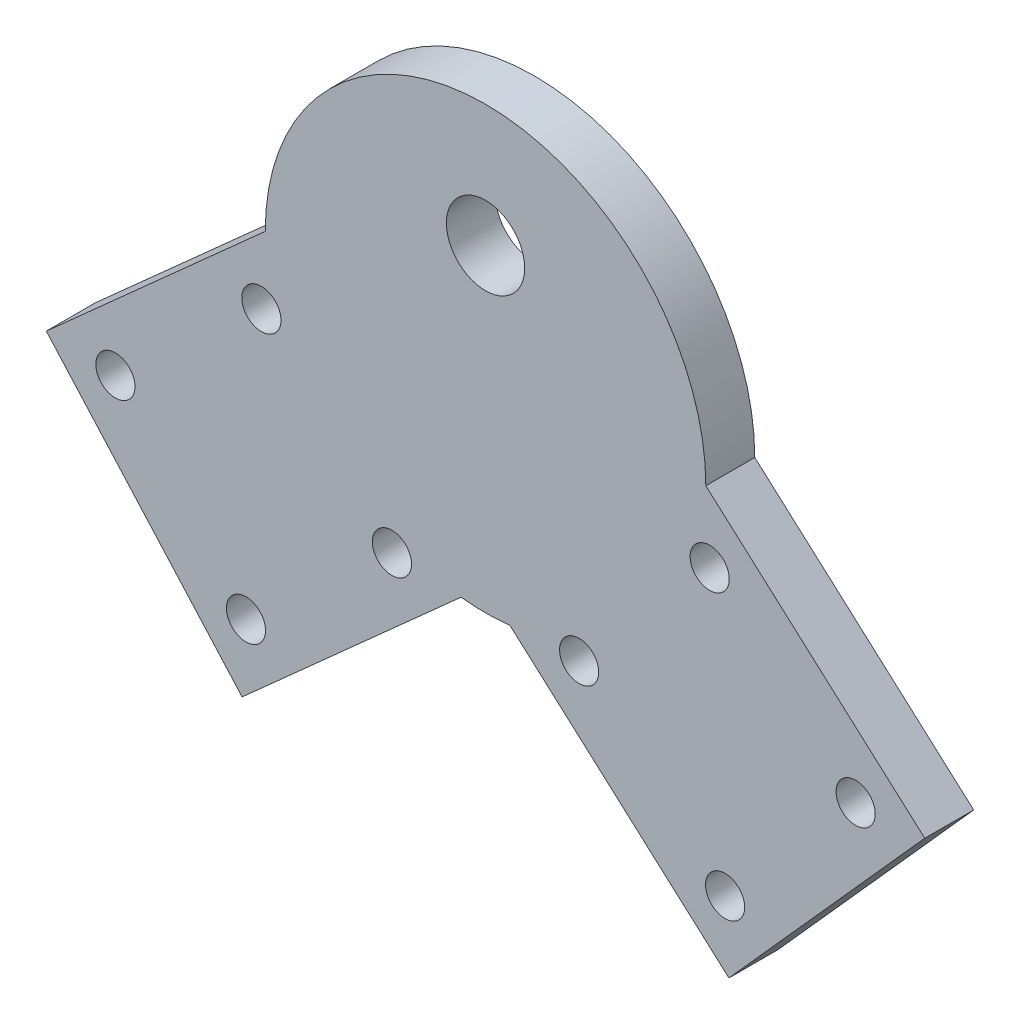
ISO-10303-21;
HEADER;
FILE_DESCRIPTION(('STEP AP214'),'2;1');
FILE_NAME('part.step','',(''),(''),'','','');
FILE_SCHEMA(('AUTOMOTIVE_DESIGN { 1 0 10303 214 1 1 1 1 }'));
ENDSEC;
DATA;
#1=APPLICATION_CONTEXT('core data for automotive mechanical design processes');
#2=APPLICATION_PROTOCOL_DEFINITION('international standard','automotive_design',2000,#1);
#3=PRODUCT_CONTEXT('',#1,'mechanical');
#4=PRODUCT('Part','Part','',(#3));
#5=PRODUCT_RELATED_PRODUCT_CATEGORY('part','',(#4));
#6=PRODUCT_DEFINITION_FORMATION('','',#4);
#7=PRODUCT_DEFINITION_CONTEXT('part definition',#1,'design');
#8=PRODUCT_DEFINITION('design','',#6,#7);
#9=PRODUCT_DEFINITION_SHAPE('','',#8);
#10=(LENGTH_UNIT() NAMED_UNIT(*) SI_UNIT(.MILLI.,.METRE.));
#11=(NAMED_UNIT(*) PLANE_ANGLE_UNIT() SI_UNIT($,.RADIAN.));
#12=(NAMED_UNIT(*) SI_UNIT($,.STERADIAN.) SOLID_ANGLE_UNIT());
#13=UNCERTAINTY_MEASURE_WITH_UNIT(LENGTH_MEASURE(1.E-05),#10,'distance_accuracy_value','');
#14=(GEOMETRIC_REPRESENTATION_CONTEXT(3) GLOBAL_UNCERTAINTY_ASSIGNED_CONTEXT((#13)) GLOBAL_UNIT_ASSIGNED_CONTEXT((#10,
#11,#12)) REPRESENTATION_CONTEXT('',''));
#15=CARTESIAN_POINT('',(0.,0.,0.));
#16=DIRECTION('',(0.,0.,1.));
#17=DIRECTION('',(1.,0.,0.));
#18=AXIS2_PLACEMENT_3D('',#15,#16,#17);
#19=CARTESIAN_POINT('',(-22.5,0.,5.));
#20=DIRECTION('',(0.666666666666667,-0.74535599249993,0.));
#21=DIRECTION('',(0.74535599249993,0.666666666666667,0.));
#22=AXIS2_PLACEMENT_3D('',#19,#20,#21);
#23=PLANE('',#22);
#24=DIRECTION('',(-0.74535599249993,-0.666666666666667,0.));
#25=VECTOR('',#24,1.);
#26=CARTESIAN_POINT('',(-22.5,0.,0.));
#27=LINE('',#26,#25);
#28=CARTESIAN_POINT('',(-22.5,0.,0.));
#29=VERTEX_POINT('',#28);
#30=CARTESIAN_POINT('',(-44.8606797749979,-20.,0.));
#31=VERTEX_POINT('',#30);
#32=EDGE_CURVE('E160',#29,#31,#27,.T.);
#33=ORIENTED_EDGE('',*,*,#32,.T.);
#34=DIRECTION('',(0.,0.,-1.));
#35=VECTOR('',#34,1.);
#36=CARTESIAN_POINT('',(-44.8606797749979,-20.,5.));
#37=LINE('',#36,#35);
#38=CARTESIAN_POINT('',(-44.8606797749979,-20.,5.));
#39=VERTEX_POINT('',#38);
#40=EDGE_CURVE('E202',#39,#31,#37,.T.);
#41=ORIENTED_EDGE('',*,*,#40,.F.);
#42=DIRECTION('',(-0.74535599249993,-0.666666666666667,0.));
#43=VECTOR('',#42,1.);
#44=CARTESIAN_POINT('',(-22.5,0.,5.));
#45=LINE('',#44,#43);
#46=CARTESIAN_POINT('',(-22.5,0.,5.));
#47=VERTEX_POINT('',#46);
#48=EDGE_CURVE('E203',#47,#39,#45,.T.);
#49=ORIENTED_EDGE('',*,*,#48,.F.);
#50=DIRECTION('',(0.,0.,-1.));
#51=VECTOR('',#50,1.);
#52=CARTESIAN_POINT('',(-22.5,0.,5.));
#53=LINE('',#52,#51);
#54=EDGE_CURVE('E85',#47,#29,#53,.T.);
#55=ORIENTED_EDGE('',*,*,#54,.T.);
#56=EDGE_LOOP('',(#33,#41,#49,#55));
#57=FACE_BOUND('',#56,.T.);
#58=ADVANCED_FACE('F74',(#57),#23,.F.);
#59=CARTESIAN_POINT('',(-44.8606797749979,-20.,5.));
#60=DIRECTION('',(0.74535599249993,0.666666666666667,0.));
#61=DIRECTION('',(-0.666666666666667,0.74535599249993,0.));
#62=AXIS2_PLACEMENT_3D('',#59,#60,#61);
#63=PLANE('',#62);
#64=DIRECTION('',(0.666666666666667,-0.74535599249993,0.));
#65=VECTOR('',#64,1.);
#66=CARTESIAN_POINT('',(-44.8606797749979,-20.,0.));
#67=LINE('',#66,#65);
#68=CARTESIAN_POINT('',(-24.8606797749979,-42.3606797749979,0.));
#69=VERTEX_POINT('',#68);
#70=EDGE_CURVE('E212',#31,#69,#67,.T.);
#71=ORIENTED_EDGE('',*,*,#70,.T.);
#72=DIRECTION('',(0.,0.,-1.));
#73=VECTOR('',#72,1.);
#74=CARTESIAN_POINT('',(-24.8606797749979,-42.3606797749979,5.));
#75=LINE('',#74,#73);
#76=CARTESIAN_POINT('',(-24.8606797749979,-42.3606797749979,5.));
#77=VERTEX_POINT('',#76);
#78=EDGE_CURVE('E199',#77,#69,#75,.T.);
#79=ORIENTED_EDGE('',*,*,#78,.F.);
#80=DIRECTION('',(0.666666666666667,-0.74535599249993,0.));
#81=VECTOR('',#80,1.);
#82=CARTESIAN_POINT('',(-44.8606797749979,-20.,5.));
#83=LINE('',#82,#81);
#84=EDGE_CURVE('E222',#39,#77,#83,.T.);
#85=ORIENTED_EDGE('',*,*,#84,.F.);
#86=ORIENTED_EDGE('',*,*,#40,.T.);
#87=EDGE_LOOP('',(#71,#79,#85,#86));
#88=FACE_BOUND('',#87,.T.);
#89=ADVANCED_FACE('F332',(#88),#63,.F.);
#90=CARTESIAN_POINT('',(-2.5,-22.3606797749979,5.));
#91=DIRECTION('',(0.666666666666667,-0.74535599249993,0.));
#92=DIRECTION('',(0.74535599249993,0.666666666666667,0.));
#93=AXIS2_PLACEMENT_3D('',#90,#91,#92);
#94=PLANE('',#93);
#95=DIRECTION('',(-0.74535599249993,-0.666666666666667,0.));
#96=VECTOR('',#95,1.);
#97=CARTESIAN_POINT('',(-2.5,-22.3606797749979,0.));
#98=LINE('',#97,#96);
#99=CARTESIAN_POINT('',(-2.5,-22.3606797749979,0.));
#100=VERTEX_POINT('',#99);
#101=EDGE_CURVE('E151',#100,#69,#98,.T.);
#102=ORIENTED_EDGE('',*,*,#101,.F.);
#103=DIRECTION('',(0.,0.,-1.));
#104=VECTOR('',#103,1.);
#105=CARTESIAN_POINT('',(-2.5,-22.3606797749979,5.));
#106=LINE('',#105,#104);
#107=CARTESIAN_POINT('',(-2.5,-22.3606797749979,5.));
#108=VERTEX_POINT('',#107);
#109=EDGE_CURVE('E12',#108,#100,#106,.T.);
#110=ORIENTED_EDGE('',*,*,#109,.F.);
#111=DIRECTION('',(-0.74535599249993,-0.666666666666667,0.));
#112=VECTOR('',#111,1.);
#113=CARTESIAN_POINT('',(-2.5,-22.3606797749979,5.));
#114=LINE('',#113,#112);
#115=EDGE_CURVE('E211',#108,#77,#114,.T.);
#116=ORIENTED_EDGE('',*,*,#115,.T.);
#117=ORIENTED_EDGE('',*,*,#78,.T.);
#118=EDGE_LOOP('',(#102,#110,#116,#117));
#119=FACE_BOUND('',#118,.T.);
#120=ADVANCED_FACE('F326',(#119),#94,.T.);
#121=CARTESIAN_POINT('',(0.,0.,0.));
#122=DIRECTION('',(0.,0.,1.));
#123=DIRECTION('',(1.,0.,0.));
#124=AXIS2_PLACEMENT_3D('',#121,#122,#123);
#125=PLANE('',#124);
#126=CARTESIAN_POINT('',(0.,10.,0.));
#127=DIRECTION('',(0.,0.,-1.));
#128=DIRECTION('',(-1.,0.,0.));
#129=AXIS2_PLACEMENT_3D('',#126,#127,#128);
#130=CIRCLE('',#129,4.);
#131=CARTESIAN_POINT('',(-4.,10.,0.));
#132=VERTEX_POINT('',#131);
#133=EDGE_CURVE('E292',#132,#132,#130,.T.);
#134=ORIENTED_EDGE('',*,*,#133,.F.);
#135=EDGE_LOOP('',(#134));
#136=FACE_BOUND('',#135,.T.);
#137=CARTESIAN_POINT('',(-24.4672331458316,-35.3005664791649,0.));
#138=DIRECTION('',(0.,0.,1.));
#139=DIRECTION('',(1.,0.,0.));
#140=AXIS2_PLACEMENT_3D('',#137,#138,#139);
#141=CIRCLE('',#140,2.);
#142=CARTESIAN_POINT('',(-22.4672331458316,-35.3005664791649,0.));
#143=VERTEX_POINT('',#142);
#144=EDGE_CURVE('E241',#143,#143,#141,.T.);
#145=ORIENTED_EDGE('',*,*,#144,.T.);
#146=EDGE_LOOP('',(#145));
#147=FACE_BOUND('',#146,.T.);
#148=CARTESIAN_POINT('',(-37.8005664791649,-20.3934466291663,0.));
#149=DIRECTION('',(0.,0.,1.));
#150=DIRECTION('',(1.,0.,0.));
#151=AXIS2_PLACEMENT_3D('',#148,#149,#150);
#152=CIRCLE('',#151,2.);
#153=CARTESIAN_POINT('',(-35.8005664791649,-20.3934466291663,0.));
#154=VERTEX_POINT('',#153);
#155=EDGE_CURVE('E249',#154,#154,#152,.T.);
#156=ORIENTED_EDGE('',*,*,#155,.T.);
#157=EDGE_LOOP('',(#156));
#158=FACE_BOUND('',#157,.T.);
#159=CARTESIAN_POINT('',(-22.8934466291663,-7.06011329583298,0.));
#160=DIRECTION('',(0.,0.,1.));
#161=DIRECTION('',(1.,0.,0.));
#162=AXIS2_PLACEMENT_3D('',#159,#160,#161);
#163=CIRCLE('',#162,2.);
#164=CARTESIAN_POINT('',(-20.8934466291663,-7.06011329583298,0.));
#165=VERTEX_POINT('',#164);
#166=EDGE_CURVE('E257',#165,#165,#163,.T.);
#167=ORIENTED_EDGE('',*,*,#166,.T.);
#168=EDGE_LOOP('',(#167));
#169=FACE_BOUND('',#168,.T.);
#170=CARTESIAN_POINT('',(-9.56011329583299,-21.9672331458316,0.));
#171=DIRECTION('',(0.,0.,1.));
#172=DIRECTION('',(1.,0.,0.));
#173=AXIS2_PLACEMENT_3D('',#170,#171,#172);
#174=CIRCLE('',#173,2.);
#175=CARTESIAN_POINT('',(-7.56011329583299,-21.9672331458316,0.));
#176=VERTEX_POINT('',#175);
#177=EDGE_CURVE('E265',#176,#176,#174,.T.);
#178=ORIENTED_EDGE('',*,*,#177,.T.);
#179=EDGE_LOOP('',(#178));
#180=FACE_BOUND('',#179,.T.);
#181=CARTESIAN_POINT('',(9.56011329583297,-21.9672331458316,0.));
#182=DIRECTION('',(0.,0.,1.));
#183=DIRECTION('',(1.,0.,0.));
#184=AXIS2_PLACEMENT_3D('',#181,#182,#183);
#185=CIRCLE('',#184,2.);
#186=CARTESIAN_POINT('',(11.560113295833,-21.9672331458316,0.));
#187=VERTEX_POINT('',#186);
#188=EDGE_CURVE('E273',#187,#187,#185,.T.);
#189=ORIENTED_EDGE('',*,*,#188,.T.);
#190=EDGE_LOOP('',(#189));
#191=FACE_BOUND('',#190,.T.);
#192=CARTESIAN_POINT('',(24.4672331458316,-35.3005664791649,0.));
#193=DIRECTION('',(0.,0.,1.));
#194=DIRECTION('',(1.,0.,0.));
#195=AXIS2_PLACEMENT_3D('',#192,#193,#194);
#196=CIRCLE('',#195,2.);
#197=CARTESIAN_POINT('',(26.4672331458316,-35.3005664791649,0.));
#198=VERTEX_POINT('',#197);
#199=EDGE_CURVE('E281',#198,#198,#196,.T.);
#200=ORIENTED_EDGE('',*,*,#199,.T.);
#201=EDGE_LOOP('',(#200));
#202=FACE_BOUND('',#201,.T.);
#203=CARTESIAN_POINT('',(37.8005664791649,-20.3934466291663,0.));
#204=DIRECTION('',(0.,0.,1.));
#205=DIRECTION('',(1.,0.,0.));
#206=AXIS2_PLACEMENT_3D('',#203,#204,#205);
#207=CIRCLE('',#206,2.);
#208=CARTESIAN_POINT('',(39.8005664791649,-20.3934466291663,0.));
#209=VERTEX_POINT('',#208);
#210=EDGE_CURVE('E233',#209,#209,#207,.T.);
#211=ORIENTED_EDGE('',*,*,#210,.T.);
#212=EDGE_LOOP('',(#211));
#213=FACE_BOUND('',#212,.T.);
#214=CARTESIAN_POINT('',(22.8934466291663,-7.06011329583298,0.));
#215=DIRECTION('',(0.,0.,1.));
#216=DIRECTION('',(1.,0.,0.));
#217=AXIS2_PLACEMENT_3D('',#214,#215,#216);
#218=CIRCLE('',#217,2.);
#219=CARTESIAN_POINT('',(24.8934466291663,-7.06011329583298,0.));
#220=VERTEX_POINT('',#219);
#221=EDGE_CURVE('E228',#220,#220,#218,.T.);
#222=ORIENTED_EDGE('',*,*,#221,.T.);
#223=EDGE_LOOP('',(#222));
#224=FACE_BOUND('',#223,.T.);
#225=ORIENTED_EDGE('',*,*,#32,.F.);
#226=CARTESIAN_POINT('',(0.,0.,0.));
#227=DIRECTION('',(0.,0.,1.));
#228=DIRECTION('',(1.,0.,0.));
#229=AXIS2_PLACEMENT_3D('',#226,#227,#228);
#230=CIRCLE('',#229,22.5);
#231=CARTESIAN_POINT('',(22.5,0.,0.));
#232=VERTEX_POINT('',#231);
#233=EDGE_CURVE('E142',#232,#29,#230,.T.);
#234=ORIENTED_EDGE('',*,*,#233,.F.);
#235=DIRECTION('',(0.74535599249993,-0.666666666666667,0.));
#236=VECTOR('',#235,1.);
#237=CARTESIAN_POINT('',(22.5,0.,0.));
#238=LINE('',#237,#236);
#239=CARTESIAN_POINT('',(44.8606797749979,-20.,0.));
#240=VERTEX_POINT('',#239);
#241=EDGE_CURVE('E158',#232,#240,#238,.T.);
#242=ORIENTED_EDGE('',*,*,#241,.T.);
#243=DIRECTION('',(0.666666666666667,0.74535599249993,0.));
#244=VECTOR('',#243,1.);
#245=CARTESIAN_POINT('',(24.8606797749979,-42.3606797749979,0.));
#246=LINE('',#245,#244);
#247=CARTESIAN_POINT('',(24.8606797749979,-42.3606797749979,0.));
#248=VERTEX_POINT('',#247);
#249=EDGE_CURVE('E168',#248,#240,#246,.T.);
#250=ORIENTED_EDGE('',*,*,#249,.F.);
#251=DIRECTION('',(0.74535599249993,-0.666666666666667,0.));
#252=VECTOR('',#251,1.);
#253=CARTESIAN_POINT('',(2.49999999999999,-22.3606797749979,0.));
#254=LINE('',#253,#252);
#255=CARTESIAN_POINT('',(2.49999999999999,-22.3606797749979,0.));
#256=VERTEX_POINT('',#255);
#257=EDGE_CURVE('E172',#256,#248,#254,.T.);
#258=ORIENTED_EDGE('',*,*,#257,.F.);
#259=EDGE_CURVE('E133',#100,#256,#230,.T.);
#260=ORIENTED_EDGE('',*,*,#259,.F.);
#261=ORIENTED_EDGE('',*,*,#101,.T.);
#262=ORIENTED_EDGE('',*,*,#70,.F.);
#263=EDGE_LOOP('',(#225,#234,#242,#250,#258,#260,#261,#262));
#264=FACE_BOUND('',#263,.T.);
#265=ADVANCED_FACE('F156',(#136,#147,#158,#169,#180,#191,#202,#213,#224,#264),#125,.F.);
#266=CARTESIAN_POINT('',(0.,0.,5.));
#267=DIRECTION('',(0.,0.,1.));
#268=DIRECTION('',(1.,0.,0.));
#269=AXIS2_PLACEMENT_3D('',#266,#267,#268);
#270=PLANE('',#269);
#271=CARTESIAN_POINT('',(0.,10.,5.));
#272=DIRECTION('',(0.,0.,1.));
#273=DIRECTION('',(1.,0.,0.));
#274=AXIS2_PLACEMENT_3D('',#271,#272,#273);
#275=CIRCLE('',#274,4.);
#276=CARTESIAN_POINT('',(4.,10.,5.));
#277=VERTEX_POINT('',#276);
#278=EDGE_CURVE('E78',#277,#277,#275,.T.);
#279=ORIENTED_EDGE('',*,*,#278,.F.);
#280=EDGE_LOOP('',(#279));
#281=FACE_BOUND('',#280,.T.);
#282=CARTESIAN_POINT('',(-24.4672331458316,-35.3005664791649,5.));
#283=DIRECTION('',(0.,0.,1.));
#284=DIRECTION('',(1.,0.,0.));
#285=AXIS2_PLACEMENT_3D('',#282,#283,#284);
#286=CIRCLE('',#285,2.);
#287=CARTESIAN_POINT('',(-22.4672331458316,-35.3005664791649,5.));
#288=VERTEX_POINT('',#287);
#289=EDGE_CURVE('E237',#288,#288,#286,.T.);
#290=ORIENTED_EDGE('',*,*,#289,.F.);
#291=EDGE_LOOP('',(#290));
#292=FACE_BOUND('',#291,.T.);
#293=CARTESIAN_POINT('',(-37.8005664791649,-20.3934466291663,5.));
#294=DIRECTION('',(0.,0.,1.));
#295=DIRECTION('',(1.,0.,0.));
#296=AXIS2_PLACEMENT_3D('',#293,#294,#295);
#297=CIRCLE('',#296,2.);
#298=CARTESIAN_POINT('',(-35.8005664791649,-20.3934466291663,5.));
#299=VERTEX_POINT('',#298);
#300=EDGE_CURVE('E245',#299,#299,#297,.T.);
#301=ORIENTED_EDGE('',*,*,#300,.F.);
#302=EDGE_LOOP('',(#301));
#303=FACE_BOUND('',#302,.T.);
#304=CARTESIAN_POINT('',(-22.8934466291663,-7.06011329583298,5.));
#305=DIRECTION('',(0.,0.,1.));
#306=DIRECTION('',(1.,0.,0.));
#307=AXIS2_PLACEMENT_3D('',#304,#305,#306);
#308=CIRCLE('',#307,2.);
#309=CARTESIAN_POINT('',(-20.8934466291663,-7.06011329583298,5.));
#310=VERTEX_POINT('',#309);
#311=EDGE_CURVE('E253',#310,#310,#308,.T.);
#312=ORIENTED_EDGE('',*,*,#311,.F.);
#313=EDGE_LOOP('',(#312));
#314=FACE_BOUND('',#313,.T.);
#315=CARTESIAN_POINT('',(-9.56011329583299,-21.9672331458316,5.));
#316=DIRECTION('',(0.,0.,1.));
#317=DIRECTION('',(1.,0.,0.));
#318=AXIS2_PLACEMENT_3D('',#315,#316,#317);
#319=CIRCLE('',#318,2.);
#320=CARTESIAN_POINT('',(-7.56011329583299,-21.9672331458316,5.));
#321=VERTEX_POINT('',#320);
#322=EDGE_CURVE('E261',#321,#321,#319,.T.);
#323=ORIENTED_EDGE('',*,*,#322,.F.);
#324=EDGE_LOOP('',(#323));
#325=FACE_BOUND('',#324,.T.);
#326=CARTESIAN_POINT('',(9.56011329583297,-21.9672331458316,5.));
#327=DIRECTION('',(0.,0.,1.));
#328=DIRECTION('',(1.,0.,0.));
#329=AXIS2_PLACEMENT_3D('',#326,#327,#328);
#330=CIRCLE('',#329,2.);
#331=CARTESIAN_POINT('',(11.560113295833,-21.9672331458316,5.));
#332=VERTEX_POINT('',#331);
#333=EDGE_CURVE('E269',#332,#332,#330,.T.);
#334=ORIENTED_EDGE('',*,*,#333,.F.);
#335=EDGE_LOOP('',(#334));
#336=FACE_BOUND('',#335,.T.);
#337=CARTESIAN_POINT('',(24.4672331458316,-35.3005664791649,5.));
#338=DIRECTION('',(0.,0.,1.));
#339=DIRECTION('',(1.,0.,0.));
#340=AXIS2_PLACEMENT_3D('',#337,#338,#339);
#341=CIRCLE('',#340,2.);
#342=CARTESIAN_POINT('',(26.4672331458316,-35.3005664791649,5.));
#343=VERTEX_POINT('',#342);
#344=EDGE_CURVE('E277',#343,#343,#341,.T.);
#345=ORIENTED_EDGE('',*,*,#344,.F.);
#346=EDGE_LOOP('',(#345));
#347=FACE_BOUND('',#346,.T.);
#348=CARTESIAN_POINT('',(37.8005664791649,-20.3934466291663,5.));
#349=DIRECTION('',(0.,0.,1.));
#350=DIRECTION('',(1.,0.,0.));
#351=AXIS2_PLACEMENT_3D('',#348,#349,#350);
#352=CIRCLE('',#351,2.);
#353=CARTESIAN_POINT('',(39.8005664791649,-20.3934466291663,5.));
#354=VERTEX_POINT('',#353);
#355=EDGE_CURVE('E285',#354,#354,#352,.T.);
#356=ORIENTED_EDGE('',*,*,#355,.F.);
#357=EDGE_LOOP('',(#356));
#358=FACE_BOUND('',#357,.T.);
#359=CARTESIAN_POINT('',(22.8934466291663,-7.06011329583298,5.));
#360=DIRECTION('',(0.,0.,1.));
#361=DIRECTION('',(1.,0.,0.));
#362=AXIS2_PLACEMENT_3D('',#359,#360,#361);
#363=CIRCLE('',#362,2.);
#364=CARTESIAN_POINT('',(24.8934466291663,-7.06011329583298,5.));
#365=VERTEX_POINT('',#364);
#366=EDGE_CURVE('E232',#365,#365,#363,.T.);
#367=ORIENTED_EDGE('',*,*,#366,.F.);
#368=EDGE_LOOP('',(#367));
#369=FACE_BOUND('',#368,.T.);
#370=ORIENTED_EDGE('',*,*,#115,.F.);
#371=CARTESIAN_POINT('',(0.,0.,5.));
#372=DIRECTION('',(0.,0.,1.));
#373=DIRECTION('',(1.,0.,0.));
#374=AXIS2_PLACEMENT_3D('',#371,#372,#373);
#375=CIRCLE('',#374,22.5);
#376=CARTESIAN_POINT('',(2.49999999999999,-22.3606797749979,5.));
#377=VERTEX_POINT('',#376);
#378=EDGE_CURVE('E162',#108,#377,#375,.T.);
#379=ORIENTED_EDGE('',*,*,#378,.T.);
#380=DIRECTION('',(0.74535599249993,-0.666666666666667,0.));
#381=VECTOR('',#380,1.);
#382=CARTESIAN_POINT('',(2.49999999999999,-22.3606797749979,5.));
#383=LINE('',#382,#381);
#384=CARTESIAN_POINT('',(24.8606797749979,-42.3606797749979,5.));
#385=VERTEX_POINT('',#384);
#386=EDGE_CURVE('E176',#377,#385,#383,.T.);
#387=ORIENTED_EDGE('',*,*,#386,.T.);
#388=DIRECTION('',(0.666666666666667,0.74535599249993,0.));
#389=VECTOR('',#388,1.);
#390=CARTESIAN_POINT('',(24.8606797749979,-42.3606797749979,5.));
#391=LINE('',#390,#389);
#392=CARTESIAN_POINT('',(44.8606797749979,-20.,5.));
#393=VERTEX_POINT('',#392);
#394=EDGE_CURVE('E190',#385,#393,#391,.T.);
#395=ORIENTED_EDGE('',*,*,#394,.T.);
#396=DIRECTION('',(0.74535599249993,-0.666666666666667,0.));
#397=VECTOR('',#396,1.);
#398=CARTESIAN_POINT('',(22.5,0.,5.));
#399=LINE('',#398,#397);
#400=CARTESIAN_POINT('',(22.5,0.,5.));
#401=VERTEX_POINT('',#400);
#402=EDGE_CURVE('E180',#401,#393,#399,.T.);
#403=ORIENTED_EDGE('',*,*,#402,.F.);
#404=EDGE_CURVE('E145',#401,#47,#375,.T.);
#405=ORIENTED_EDGE('',*,*,#404,.T.);
#406=ORIENTED_EDGE('',*,*,#48,.T.);
#407=ORIENTED_EDGE('',*,*,#84,.T.);
#408=EDGE_LOOP('',(#370,#379,#387,#395,#403,#405,#406,#407));
#409=FACE_BOUND('',#408,.T.);
#410=ADVANCED_FACE('F303',(#281,#292,#303,#314,#325,#336,#347,#358,#369,#409),#270,.T.);
#411=CARTESIAN_POINT('',(24.8606797749979,-42.3606797749979,5.));
#412=DIRECTION('',(-0.74535599249993,0.666666666666667,0.));
#413=DIRECTION('',(-0.666666666666667,-0.74535599249993,0.));
#414=AXIS2_PLACEMENT_3D('',#411,#412,#413);
#415=PLANE('',#414);
#416=ORIENTED_EDGE('',*,*,#249,.T.);
#417=DIRECTION('',(0.,0.,-1.));
#418=VECTOR('',#417,1.);
#419=CARTESIAN_POINT('',(44.8606797749979,-20.,5.));
#420=LINE('',#419,#418);
#421=EDGE_CURVE('E165',#393,#240,#420,.T.);
#422=ORIENTED_EDGE('',*,*,#421,.F.);
#423=ORIENTED_EDGE('',*,*,#394,.F.);
#424=DIRECTION('',(0.,0.,-1.));
#425=VECTOR('',#424,1.);
#426=CARTESIAN_POINT('',(24.8606797749979,-42.3606797749979,5.));
#427=LINE('',#426,#425);
#428=EDGE_CURVE('E184',#385,#248,#427,.T.);
#429=ORIENTED_EDGE('',*,*,#428,.T.);
#430=EDGE_LOOP('',(#416,#422,#423,#429));
#431=FACE_BOUND('',#430,.T.);
#432=ADVANCED_FACE('F306',(#431),#415,.F.);
#433=CARTESIAN_POINT('',(2.49999999999999,-22.3606797749979,5.));
#434=DIRECTION('',(0.666666666666667,0.74535599249993,0.));
#435=DIRECTION('',(-0.74535599249993,0.666666666666667,0.));
#436=AXIS2_PLACEMENT_3D('',#433,#434,#435);
#437=PLANE('',#436);
#438=ORIENTED_EDGE('',*,*,#257,.T.);
#439=ORIENTED_EDGE('',*,*,#428,.F.);
#440=ORIENTED_EDGE('',*,*,#386,.F.);
#441=DIRECTION('',(0.,0.,-1.));
#442=VECTOR('',#441,1.);
#443=CARTESIAN_POINT('',(2.49999999999999,-22.3606797749979,5.));
#444=LINE('',#443,#442);
#445=EDGE_CURVE('E152',#377,#256,#444,.T.);
#446=ORIENTED_EDGE('',*,*,#445,.T.);
#447=EDGE_LOOP('',(#438,#439,#440,#446));
#448=FACE_BOUND('',#447,.T.);
#449=ADVANCED_FACE('F337',(#448),#437,.F.);
#450=CARTESIAN_POINT('',(22.5,0.,5.));
#451=DIRECTION('',(0.666666666666667,0.74535599249993,0.));
#452=DIRECTION('',(-0.74535599249993,0.666666666666667,0.));
#453=AXIS2_PLACEMENT_3D('',#450,#451,#452);
#454=PLANE('',#453);
#455=ORIENTED_EDGE('',*,*,#241,.F.);
#456=DIRECTION('',(0.,0.,-1.));
#457=VECTOR('',#456,1.);
#458=CARTESIAN_POINT('',(22.5,0.,5.));
#459=LINE('',#458,#457);
#460=EDGE_CURVE('E139',#401,#232,#459,.T.);
#461=ORIENTED_EDGE('',*,*,#460,.F.);
#462=ORIENTED_EDGE('',*,*,#402,.T.);
#463=ORIENTED_EDGE('',*,*,#421,.T.);
#464=EDGE_LOOP('',(#455,#461,#462,#463));
#465=FACE_BOUND('',#464,.T.);
#466=ADVANCED_FACE('F163',(#465),#454,.T.);
#467=CARTESIAN_POINT('',(0.,0.,5.));
#468=DIRECTION('',(0.,0.,-1.));
#469=DIRECTION('',(-1.,0.,0.));
#470=AXIS2_PLACEMENT_3D('',#467,#468,#469);
#471=CYLINDRICAL_SURFACE('',#470,22.5);
#472=ORIENTED_EDGE('',*,*,#109,.T.);
#473=ORIENTED_EDGE('',*,*,#259,.T.);
#474=ORIENTED_EDGE('',*,*,#445,.F.);
#475=ORIENTED_EDGE('',*,*,#378,.F.);
#476=EDGE_LOOP('',(#472,#473,#474,#475));
#477=FACE_BOUND('',#476,.T.);
#478=ADVANCED_FACE('F76',(#477),#471,.T.);
#479=ORIENTED_EDGE('',*,*,#233,.T.);
#480=ORIENTED_EDGE('',*,*,#54,.F.);
#481=ORIENTED_EDGE('',*,*,#404,.F.);
#482=ORIENTED_EDGE('',*,*,#460,.T.);
#483=EDGE_LOOP('',(#479,#480,#481,#482));
#484=FACE_BOUND('',#483,.T.);
#485=ADVANCED_FACE('F141',(#484),#471,.T.);
#486=CARTESIAN_POINT('',(22.8934466291663,-7.06011329583298,5.));
#487=DIRECTION('',(0.,0.,-1.));
#488=DIRECTION('',(-1.,0.,0.));
#489=AXIS2_PLACEMENT_3D('',#486,#487,#488);
#490=CYLINDRICAL_SURFACE('',#489,2.);
#491=ORIENTED_EDGE('',*,*,#366,.T.);
#492=EDGE_LOOP('',(#491));
#493=FACE_BOUND('',#492,.T.);
#494=ORIENTED_EDGE('',*,*,#221,.F.);
#495=EDGE_LOOP('',(#494));
#496=FACE_BOUND('',#495,.T.);
#497=ADVANCED_FACE('F379',(#493,#496),#490,.F.);
#498=CARTESIAN_POINT('',(37.8005664791649,-20.3934466291663,5.));
#499=DIRECTION('',(0.,0.,-1.));
#500=DIRECTION('',(-1.,0.,0.));
#501=AXIS2_PLACEMENT_3D('',#498,#499,#500);
#502=CYLINDRICAL_SURFACE('',#501,2.);
#503=ORIENTED_EDGE('',*,*,#355,.T.);
#504=EDGE_LOOP('',(#503));
#505=FACE_BOUND('',#504,.T.);
#506=ORIENTED_EDGE('',*,*,#210,.F.);
#507=EDGE_LOOP('',(#506));
#508=FACE_BOUND('',#507,.T.);
#509=ADVANCED_FACE('F381',(#505,#508),#502,.F.);
#510=CARTESIAN_POINT('',(24.4672331458316,-35.3005664791649,5.));
#511=DIRECTION('',(0.,0.,-1.));
#512=DIRECTION('',(-1.,0.,0.));
#513=AXIS2_PLACEMENT_3D('',#510,#511,#512);
#514=CYLINDRICAL_SURFACE('',#513,2.);
#515=ORIENTED_EDGE('',*,*,#344,.T.);
#516=EDGE_LOOP('',(#515));
#517=FACE_BOUND('',#516,.T.);
#518=ORIENTED_EDGE('',*,*,#199,.F.);
#519=EDGE_LOOP('',(#518));
#520=FACE_BOUND('',#519,.T.);
#521=ADVANCED_FACE('F388',(#517,#520),#514,.F.);
#522=CARTESIAN_POINT('',(9.56011329583297,-21.9672331458316,5.));
#523=DIRECTION('',(0.,0.,-1.));
#524=DIRECTION('',(-1.,0.,0.));
#525=AXIS2_PLACEMENT_3D('',#522,#523,#524);
#526=CYLINDRICAL_SURFACE('',#525,2.);
#527=ORIENTED_EDGE('',*,*,#333,.T.);
#528=EDGE_LOOP('',(#527));
#529=FACE_BOUND('',#528,.T.);
#530=ORIENTED_EDGE('',*,*,#188,.F.);
#531=EDGE_LOOP('',(#530));
#532=FACE_BOUND('',#531,.T.);
#533=ADVANCED_FACE('F422',(#529,#532),#526,.F.);
#534=CARTESIAN_POINT('',(-9.56011329583299,-21.9672331458316,5.));
#535=DIRECTION('',(0.,0.,-1.));
#536=DIRECTION('',(-1.,0.,0.));
#537=AXIS2_PLACEMENT_3D('',#534,#535,#536);
#538=CYLINDRICAL_SURFACE('',#537,2.);
#539=ORIENTED_EDGE('',*,*,#322,.T.);
#540=EDGE_LOOP('',(#539));
#541=FACE_BOUND('',#540,.T.);
#542=ORIENTED_EDGE('',*,*,#177,.F.);
#543=EDGE_LOOP('',(#542));
#544=FACE_BOUND('',#543,.T.);
#545=ADVANCED_FACE('F432',(#541,#544),#538,.F.);
#546=CARTESIAN_POINT('',(-22.8934466291663,-7.06011329583298,5.));
#547=DIRECTION('',(0.,0.,-1.));
#548=DIRECTION('',(-1.,0.,0.));
#549=AXIS2_PLACEMENT_3D('',#546,#547,#548);
#550=CYLINDRICAL_SURFACE('',#549,2.);
#551=ORIENTED_EDGE('',*,*,#311,.T.);
#552=EDGE_LOOP('',(#551));
#553=FACE_BOUND('',#552,.T.);
#554=ORIENTED_EDGE('',*,*,#166,.F.);
#555=EDGE_LOOP('',(#554));
#556=FACE_BOUND('',#555,.T.);
#557=ADVANCED_FACE('F442',(#553,#556),#550,.F.);
#558=CARTESIAN_POINT('',(-37.8005664791649,-20.3934466291663,5.));
#559=DIRECTION('',(0.,0.,-1.));
#560=DIRECTION('',(-1.,0.,0.));
#561=AXIS2_PLACEMENT_3D('',#558,#559,#560);
#562=CYLINDRICAL_SURFACE('',#561,2.);
#563=ORIENTED_EDGE('',*,*,#300,.T.);
#564=EDGE_LOOP('',(#563));
#565=FACE_BOUND('',#564,.T.);
#566=ORIENTED_EDGE('',*,*,#155,.F.);
#567=EDGE_LOOP('',(#566));
#568=FACE_BOUND('',#567,.T.);
#569=ADVANCED_FACE('F452',(#565,#568),#562,.F.);
#570=CARTESIAN_POINT('',(-24.4672331458316,-35.3005664791649,5.));
#571=DIRECTION('',(0.,0.,-1.));
#572=DIRECTION('',(-1.,0.,0.));
#573=AXIS2_PLACEMENT_3D('',#570,#571,#572);
#574=CYLINDRICAL_SURFACE('',#573,2.);
#575=ORIENTED_EDGE('',*,*,#289,.T.);
#576=EDGE_LOOP('',(#575));
#577=FACE_BOUND('',#576,.T.);
#578=ORIENTED_EDGE('',*,*,#144,.F.);
#579=EDGE_LOOP('',(#578));
#580=FACE_BOUND('',#579,.T.);
#581=ADVANCED_FACE('F462',(#577,#580),#574,.F.);
#582=CARTESIAN_POINT('',(0.,10.,10.));
#583=DIRECTION('',(0.,0.,-1.));
#584=DIRECTION('',(-1.,0.,0.));
#585=AXIS2_PLACEMENT_3D('',#582,#583,#584);
#586=CYLINDRICAL_SURFACE('',#585,4.);
#587=ORIENTED_EDGE('',*,*,#278,.T.);
#588=EDGE_LOOP('',(#587));
#589=FACE_BOUND('',#588,.T.);
#590=ORIENTED_EDGE('',*,*,#133,.T.);
#591=EDGE_LOOP('',(#590));
#592=FACE_BOUND('',#591,.T.);
#593=ADVANCED_FACE('F301',(#589,#592),#586,.F.);
#594=CLOSED_SHELL('',(#58,#89,#120,#265,#410,#432,#449,#466,#478,#485,#497,#509,#521,#533,#545,
#557,#569,#581,#593));
#595=MANIFOLD_SOLID_BREP('B2',#594);
#596=ADVANCED_BREP_SHAPE_REPRESENTATION('',(#18,#595),#14);
#597=SHAPE_DEFINITION_REPRESENTATION(#9,#596);
ENDSEC;
END-ISO-10303-21;
